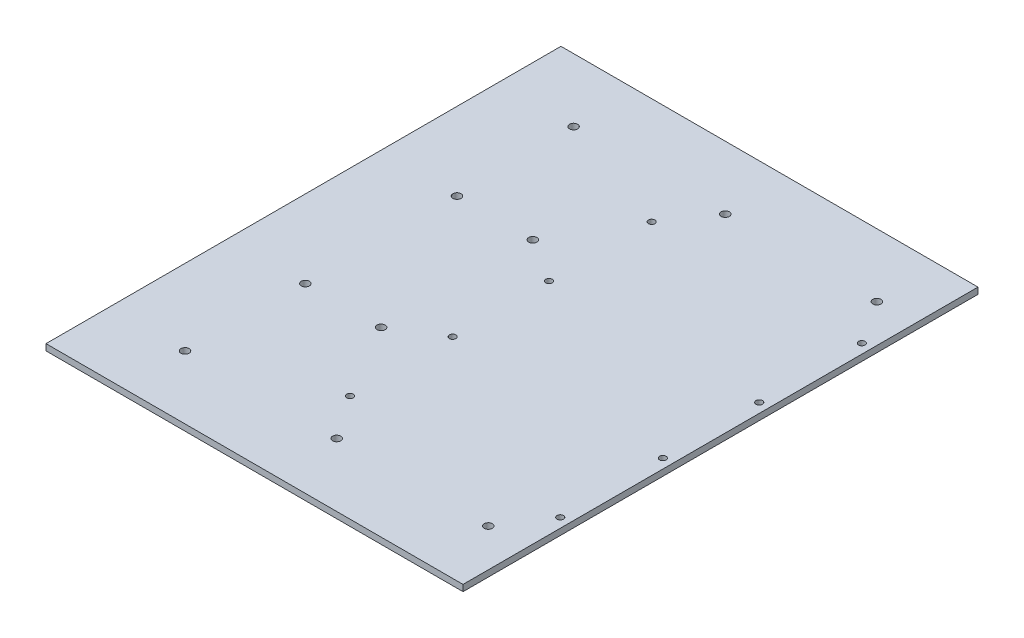
ISO-10303-21;
HEADER;
FILE_DESCRIPTION(('STEP AP214'),'2;1');
FILE_NAME('part.step','',(''),(''),'','','');
FILE_SCHEMA(('AUTOMOTIVE_DESIGN { 1 0 10303 214 1 1 1 1 }'));
ENDSEC;
DATA;
#1=APPLICATION_CONTEXT('core data for automotive mechanical design processes');
#2=APPLICATION_PROTOCOL_DEFINITION('international standard','automotive_design',2000,#1);
#3=PRODUCT_CONTEXT('',#1,'mechanical');
#4=PRODUCT('Part','Part','',(#3));
#5=PRODUCT_RELATED_PRODUCT_CATEGORY('part','',(#4));
#6=PRODUCT_DEFINITION_FORMATION('','',#4);
#7=PRODUCT_DEFINITION_CONTEXT('part definition',#1,'design');
#8=PRODUCT_DEFINITION('design','',#6,#7);
#9=PRODUCT_DEFINITION_SHAPE('','',#8);
#10=(LENGTH_UNIT() NAMED_UNIT(*) SI_UNIT(.MILLI.,.METRE.));
#11=(NAMED_UNIT(*) PLANE_ANGLE_UNIT() SI_UNIT($,.RADIAN.));
#12=(NAMED_UNIT(*) SI_UNIT($,.STERADIAN.) SOLID_ANGLE_UNIT());
#13=UNCERTAINTY_MEASURE_WITH_UNIT(LENGTH_MEASURE(1.E-05),#10,'distance_accuracy_value','');
#14=(GEOMETRIC_REPRESENTATION_CONTEXT(3) GLOBAL_UNCERTAINTY_ASSIGNED_CONTEXT((#13)) GLOBAL_UNIT_ASSIGNED_CONTEXT((#10,
#11,#12)) REPRESENTATION_CONTEXT('',''));
#15=CARTESIAN_POINT('',(0.,0.,0.));
#16=DIRECTION('',(0.,0.,1.));
#17=DIRECTION('',(1.,0.,0.));
#18=AXIS2_PLACEMENT_3D('',#15,#16,#17);
#19=CARTESIAN_POINT('',(0.,0.,0.));
#20=DIRECTION('',(0.,-1.,0.));
#21=DIRECTION('',(0.,0.,-1.));
#22=AXIS2_PLACEMENT_3D('',#19,#20,#21);
#23=PLANE('',#22);
#24=CARTESIAN_POINT('',(112.432352941177,0.,195.262500000001));
#25=DIRECTION('',(0.,1.,0.));
#26=DIRECTION('',(0.,0.,1.));
#27=AXIS2_PLACEMENT_3D('',#24,#25,#26);
#28=CIRCLE('',#27,4.10209999999999);
#29=CARTESIAN_POINT('',(112.432352941177,0.,199.364600000001));
#30=VERTEX_POINT('',#29);
#31=EDGE_CURVE('E206',#30,#30,#28,.T.);
#32=ORIENTED_EDGE('',*,*,#31,.F.);
#33=EDGE_LOOP('',(#32));
#34=FACE_BOUND('',#33,.T.);
#35=CARTESIAN_POINT('',(-39.9676470588235,0.,195.262500000002));
#36=DIRECTION('',(0.,1.,0.));
#37=DIRECTION('',(0.,0.,1.));
#38=AXIS2_PLACEMENT_3D('',#35,#36,#37);
#39=CIRCLE('',#38,4.10209999999999);
#40=CARTESIAN_POINT('',(-39.9676470588235,0.,199.364600000002));
#41=VERTEX_POINT('',#40);
#42=EDGE_CURVE('E212',#41,#41,#39,.T.);
#43=ORIENTED_EDGE('',*,*,#42,.F.);
#44=EDGE_LOOP('',(#43));
#45=FACE_BOUND('',#44,.T.);
#46=CARTESIAN_POINT('',(264.832352941177,0.,-195.2625));
#47=DIRECTION('',(0.,1.,0.));
#48=DIRECTION('',(0.,0.,1.));
#49=AXIS2_PLACEMENT_3D('',#46,#47,#48);
#50=CIRCLE('',#49,4.10209999999999);
#51=CARTESIAN_POINT('',(264.832352941177,0.,-191.1604));
#52=VERTEX_POINT('',#51);
#53=EDGE_CURVE('E228',#52,#52,#50,.T.);
#54=ORIENTED_EDGE('',*,*,#53,.F.);
#55=EDGE_LOOP('',(#54));
#56=FACE_BOUND('',#55,.T.);
#57=CARTESIAN_POINT('',(-39.9676470588235,0.,-195.262499999998));
#58=DIRECTION('',(0.,1.,0.));
#59=DIRECTION('',(0.,0.,1.));
#60=AXIS2_PLACEMENT_3D('',#57,#58,#59);
#61=CIRCLE('',#60,4.10209999999999);
#62=CARTESIAN_POINT('',(-39.9676470588235,0.,-191.160399999998));
#63=VERTEX_POINT('',#62);
#64=EDGE_CURVE('E221',#63,#63,#61,.T.);
#65=ORIENTED_EDGE('',*,*,#64,.F.);
#66=EDGE_LOOP('',(#65));
#67=FACE_BOUND('',#66,.T.);
#68=CARTESIAN_POINT('',(112.432352941177,0.,-195.262499999999));
#69=DIRECTION('',(0.,1.,0.));
#70=DIRECTION('',(0.,0.,1.));
#71=AXIS2_PLACEMENT_3D('',#68,#69,#70);
#72=CIRCLE('',#71,4.10209999999999);
#73=CARTESIAN_POINT('',(112.432352941177,0.,-191.160399999999));
#74=VERTEX_POINT('',#73);
#75=EDGE_CURVE('E220',#74,#74,#72,.T.);
#76=ORIENTED_EDGE('',*,*,#75,.F.);
#77=EDGE_LOOP('',(#76));
#78=FACE_BOUND('',#77,.T.);
#79=CARTESIAN_POINT('',(264.832352941177,0.,195.2625));
#80=DIRECTION('',(0.,1.,0.));
#81=DIRECTION('',(0.,0.,1.));
#82=AXIS2_PLACEMENT_3D('',#79,#80,#81);
#83=CIRCLE('',#82,4.10209999999999);
#84=CARTESIAN_POINT('',(264.832352941177,0.,199.3646));
#85=VERTEX_POINT('',#84);
#86=EDGE_CURVE('E210',#85,#85,#83,.T.);
#87=ORIENTED_EDGE('',*,*,#86,.F.);
#88=EDGE_LOOP('',(#87));
#89=FACE_BOUND('',#88,.T.);
#90=CARTESIAN_POINT('',(-38.1,0.,76.2));
#91=DIRECTION('',(0.,1.,0.));
#92=DIRECTION('',(0.,0.,1.));
#93=AXIS2_PLACEMENT_3D('',#90,#91,#92);
#94=CIRCLE('',#93,4.1021);
#95=CARTESIAN_POINT('',(-38.1,0.,80.3021));
#96=VERTEX_POINT('',#95);
#97=EDGE_CURVE('E239',#96,#96,#94,.T.);
#98=ORIENTED_EDGE('',*,*,#97,.F.);
#99=EDGE_LOOP('',(#98));
#100=FACE_BOUND('',#99,.T.);
#101=CARTESIAN_POINT('',(38.1,0.,76.2));
#102=DIRECTION('',(0.,1.,0.));
#103=DIRECTION('',(0.,0.,1.));
#104=AXIS2_PLACEMENT_3D('',#101,#102,#103);
#105=CIRCLE('',#104,4.1021);
#106=CARTESIAN_POINT('',(38.1,0.,80.3021));
#107=VERTEX_POINT('',#106);
#108=EDGE_CURVE('E246',#107,#107,#105,.T.);
#109=ORIENTED_EDGE('',*,*,#108,.F.);
#110=EDGE_LOOP('',(#109));
#111=FACE_BOUND('',#110,.T.);
#112=CARTESIAN_POINT('',(38.1,0.,-76.2));
#113=DIRECTION('',(0.,1.,0.));
#114=DIRECTION('',(0.,0.,1.));
#115=AXIS2_PLACEMENT_3D('',#112,#113,#114);
#116=CIRCLE('',#115,4.1021);
#117=CARTESIAN_POINT('',(38.1,0.,-72.0979));
#118=VERTEX_POINT('',#117);
#119=EDGE_CURVE('E252',#118,#118,#116,.T.);
#120=ORIENTED_EDGE('',*,*,#119,.F.);
#121=EDGE_LOOP('',(#120));
#122=FACE_BOUND('',#121,.T.);
#123=CARTESIAN_POINT('',(-38.1,0.,-76.2));
#124=DIRECTION('',(0.,1.,0.));
#125=DIRECTION('',(0.,0.,1.));
#126=AXIS2_PLACEMENT_3D('',#123,#124,#125);
#127=CIRCLE('',#126,4.1021);
#128=CARTESIAN_POINT('',(-38.1,0.,-72.0979));
#129=VERTEX_POINT('',#128);
#130=EDGE_CURVE('E258',#129,#129,#127,.T.);
#131=ORIENTED_EDGE('',*,*,#130,.F.);
#132=EDGE_LOOP('',(#131));
#133=FACE_BOUND('',#132,.T.);
#134=CARTESIAN_POINT('',(82.1428529411764,0.,48.4380000000001));
#135=DIRECTION('',(0.,1.,0.));
#136=DIRECTION('',(0.,0.,1.));
#137=AXIS2_PLACEMENT_3D('',#134,#135,#136);
#138=CIRCLE('',#137,3.26389999999999);
#139=CARTESIAN_POINT('',(82.1428529411764,0.,51.7019));
#140=VERTEX_POINT('',#139);
#141=EDGE_CURVE('E276',#140,#140,#138,.T.);
#142=ORIENTED_EDGE('',*,*,#141,.F.);
#143=EDGE_LOOP('',(#142));
#144=FACE_BOUND('',#143,.T.);
#145=CARTESIAN_POINT('',(293.407352941176,0.,48.438));
#146=DIRECTION('',(0.,1.,0.));
#147=DIRECTION('',(0.,0.,1.));
#148=AXIS2_PLACEMENT_3D('',#145,#146,#147);
#149=CIRCLE('',#148,3.26389999999999);
#150=CARTESIAN_POINT('',(293.407352941176,0.,51.7019));
#151=VERTEX_POINT('',#150);
#152=EDGE_CURVE('E282',#151,#151,#149,.T.);
#153=ORIENTED_EDGE('',*,*,#152,.F.);
#154=EDGE_LOOP('',(#153));
#155=FACE_BOUND('',#154,.T.);
#156=CARTESIAN_POINT('',(293.407352941176,0.,-48.438));
#157=DIRECTION('',(0.,1.,0.));
#158=DIRECTION('',(0.,0.,1.));
#159=AXIS2_PLACEMENT_3D('',#156,#157,#158);
#160=CIRCLE('',#159,3.26389999999999);
#161=CARTESIAN_POINT('',(293.407352941176,0.,-45.1741));
#162=VERTEX_POINT('',#161);
#163=EDGE_CURVE('E288',#162,#162,#160,.T.);
#164=ORIENTED_EDGE('',*,*,#163,.F.);
#165=EDGE_LOOP('',(#164));
#166=FACE_BOUND('',#165,.T.);
#167=CARTESIAN_POINT('',(82.1428529411764,0.,-48.4380000000001));
#168=DIRECTION('',(0.,1.,0.));
#169=DIRECTION('',(0.,0.,1.));
#170=AXIS2_PLACEMENT_3D('',#167,#168,#169);
#171=CIRCLE('',#170,3.26389999999999);
#172=CARTESIAN_POINT('',(82.1428529411764,0.,-45.1741000000001));
#173=VERTEX_POINT('',#172);
#174=EDGE_CURVE('E294',#173,#173,#171,.T.);
#175=ORIENTED_EDGE('',*,*,#174,.F.);
#176=EDGE_LOOP('',(#175));
#177=FACE_BOUND('',#176,.T.);
#178=CARTESIAN_POINT('',(82.1428529411764,0.,-151.562));
#179=DIRECTION('',(0.,1.,0.));
#180=DIRECTION('',(0.,0.,1.));
#181=AXIS2_PLACEMENT_3D('',#178,#179,#180);
#182=CIRCLE('',#181,3.26389999999999);
#183=CARTESIAN_POINT('',(82.1428529411764,0.,-148.2981));
#184=VERTEX_POINT('',#183);
#185=EDGE_CURVE('E300',#184,#184,#182,.T.);
#186=ORIENTED_EDGE('',*,*,#185,.F.);
#187=EDGE_LOOP('',(#186));
#188=FACE_BOUND('',#187,.T.);
#189=DIRECTION('',(0.,0.,-1.));
#190=VECTOR('',#189,1.);
#191=CARTESIAN_POINT('',(302.932352941177,0.,258.7625));
#192=LINE('',#191,#190);
#193=CARTESIAN_POINT('',(302.932352941177,0.,258.7625));
#194=VERTEX_POINT('',#193);
#195=CARTESIAN_POINT('',(302.932352941177,0.,-258.7625));
#196=VERTEX_POINT('',#195);
#197=EDGE_CURVE('E98',#194,#196,#192,.T.);
#198=ORIENTED_EDGE('',*,*,#197,.T.);
#199=DIRECTION('',(-1.,0.,0.));
#200=VECTOR('',#199,1.);
#201=CARTESIAN_POINT('',(-116.167647058823,0.,-258.7625));
#202=LINE('',#201,#200);
#203=CARTESIAN_POINT('',(-116.167647058823,0.,-258.7625));
#204=VERTEX_POINT('',#203);
#205=EDGE_CURVE('E101',#196,#204,#202,.T.);
#206=ORIENTED_EDGE('',*,*,#205,.T.);
#207=DIRECTION('',(0.,0.,1.));
#208=VECTOR('',#207,1.);
#209=CARTESIAN_POINT('',(-116.167647058823,0.,258.7625));
#210=LINE('',#209,#208);
#211=CARTESIAN_POINT('',(-116.167647058823,0.,258.7625));
#212=VERTEX_POINT('',#211);
#213=EDGE_CURVE('E83',#204,#212,#210,.T.);
#214=ORIENTED_EDGE('',*,*,#213,.T.);
#215=DIRECTION('',(1.,0.,0.));
#216=VECTOR('',#215,1.);
#217=CARTESIAN_POINT('',(-116.167647058823,0.,258.7625));
#218=LINE('',#217,#216);
#219=EDGE_CURVE('E93',#212,#194,#218,.T.);
#220=ORIENTED_EDGE('',*,*,#219,.T.);
#221=EDGE_LOOP('',(#198,#206,#214,#220));
#222=FACE_BOUND('',#221,.T.);
#223=CARTESIAN_POINT('',(293.407352941177,0.,-151.562));
#224=DIRECTION('',(0.,1.,0.));
#225=DIRECTION('',(0.,0.,1.));
#226=AXIS2_PLACEMENT_3D('',#223,#224,#225);
#227=CIRCLE('',#226,3.26389999999999);
#228=CARTESIAN_POINT('',(293.407352941177,0.,-148.2981));
#229=VERTEX_POINT('',#228);
#230=EDGE_CURVE('E306',#229,#229,#227,.T.);
#231=ORIENTED_EDGE('',*,*,#230,.F.);
#232=EDGE_LOOP('',(#231));
#233=FACE_BOUND('',#232,.T.);
#234=CARTESIAN_POINT('',(293.407352941177,0.,151.562));
#235=DIRECTION('',(0.,1.,0.));
#236=DIRECTION('',(0.,0.,1.));
#237=AXIS2_PLACEMENT_3D('',#234,#235,#236);
#238=CIRCLE('',#237,3.26389999999999);
#239=CARTESIAN_POINT('',(293.407352941177,0.,154.8259));
#240=VERTEX_POINT('',#239);
#241=EDGE_CURVE('E270',#240,#240,#238,.T.);
#242=ORIENTED_EDGE('',*,*,#241,.F.);
#243=EDGE_LOOP('',(#242));
#244=FACE_BOUND('',#243,.T.);
#245=CARTESIAN_POINT('',(82.1428529411764,0.,151.562));
#246=DIRECTION('',(0.,1.,0.));
#247=DIRECTION('',(0.,0.,1.));
#248=AXIS2_PLACEMENT_3D('',#245,#246,#247);
#249=CIRCLE('',#248,3.26389999999999);
#250=CARTESIAN_POINT('',(82.1428529411764,0.,154.8259));
#251=VERTEX_POINT('',#250);
#252=EDGE_CURVE('E264',#251,#251,#249,.T.);
#253=ORIENTED_EDGE('',*,*,#252,.F.);
#254=EDGE_LOOP('',(#253));
#255=FACE_BOUND('',#254,.T.);
#256=ADVANCED_FACE('F32',(#34,#45,#56,#67,#78,#89,#100,#111,#122,#133,#144,#155,#166,#177,#188,
#222,#233,#244,#255),#23,.F.);
#257=CARTESIAN_POINT('',(302.932352941177,-6.35,258.7625));
#258=DIRECTION('',(1.,0.,0.));
#259=DIRECTION('',(0.,0.,-1.));
#260=AXIS2_PLACEMENT_3D('',#257,#258,#259);
#261=PLANE('',#260);
#262=ORIENTED_EDGE('',*,*,#197,.F.);
#263=DIRECTION('',(0.,1.,0.));
#264=VECTOR('',#263,1.);
#265=CARTESIAN_POINT('',(302.932352941177,-6.35,258.7625));
#266=LINE('',#265,#264);
#267=CARTESIAN_POINT('',(302.932352941177,-6.35,258.7625));
#268=VERTEX_POINT('',#267);
#269=EDGE_CURVE('E11',#268,#194,#266,.T.);
#270=ORIENTED_EDGE('',*,*,#269,.F.);
#271=DIRECTION('',(0.,0.,-1.));
#272=VECTOR('',#271,1.);
#273=CARTESIAN_POINT('',(302.932352941177,-6.35,258.7625));
#274=LINE('',#273,#272);
#275=CARTESIAN_POINT('',(302.932352941177,-6.35,-258.7625));
#276=VERTEX_POINT('',#275);
#277=EDGE_CURVE('E91',#268,#276,#274,.T.);
#278=ORIENTED_EDGE('',*,*,#277,.T.);
#279=DIRECTION('',(0.,1.,0.));
#280=VECTOR('',#279,1.);
#281=CARTESIAN_POINT('',(302.932352941177,-6.35,-258.7625));
#282=LINE('',#281,#280);
#283=EDGE_CURVE('E36',#276,#196,#282,.T.);
#284=ORIENTED_EDGE('',*,*,#283,.T.);
#285=EDGE_LOOP('',(#262,#270,#278,#284));
#286=FACE_BOUND('',#285,.T.);
#287=ADVANCED_FACE('F34',(#286),#261,.T.);
#288=CARTESIAN_POINT('',(-116.167647058823,-6.35,258.7625));
#289=DIRECTION('',(0.,0.,1.));
#290=DIRECTION('',(1.,0.,0.));
#291=AXIS2_PLACEMENT_3D('',#288,#289,#290);
#292=PLANE('',#291);
#293=ORIENTED_EDGE('',*,*,#219,.F.);
#294=DIRECTION('',(0.,1.,0.));
#295=VECTOR('',#294,1.);
#296=CARTESIAN_POINT('',(-116.167647058823,-6.35,258.7625));
#297=LINE('',#296,#295);
#298=CARTESIAN_POINT('',(-116.167647058823,-6.35,258.7625));
#299=VERTEX_POINT('',#298);
#300=EDGE_CURVE('E42',#299,#212,#297,.T.);
#301=ORIENTED_EDGE('',*,*,#300,.F.);
#302=DIRECTION('',(1.,0.,0.));
#303=VECTOR('',#302,1.);
#304=CARTESIAN_POINT('',(-116.167647058823,-6.35,258.7625));
#305=LINE('',#304,#303);
#306=EDGE_CURVE('E88',#299,#268,#305,.T.);
#307=ORIENTED_EDGE('',*,*,#306,.T.);
#308=ORIENTED_EDGE('',*,*,#269,.T.);
#309=EDGE_LOOP('',(#293,#301,#307,#308));
#310=FACE_BOUND('',#309,.T.);
#311=ADVANCED_FACE('F109',(#310),#292,.T.);
#312=CARTESIAN_POINT('',(-116.167647058823,-6.35,258.7625));
#313=DIRECTION('',(-1.,0.,0.));
#314=DIRECTION('',(0.,0.,1.));
#315=AXIS2_PLACEMENT_3D('',#312,#313,#314);
#316=PLANE('',#315);
#317=ORIENTED_EDGE('',*,*,#213,.F.);
#318=DIRECTION('',(0.,1.,0.));
#319=VECTOR('',#318,1.);
#320=CARTESIAN_POINT('',(-116.167647058823,-6.35,-258.7625));
#321=LINE('',#320,#319);
#322=CARTESIAN_POINT('',(-116.167647058823,-6.35,-258.7625));
#323=VERTEX_POINT('',#322);
#324=EDGE_CURVE('E78',#323,#204,#321,.T.);
#325=ORIENTED_EDGE('',*,*,#324,.F.);
#326=DIRECTION('',(0.,0.,1.));
#327=VECTOR('',#326,1.);
#328=CARTESIAN_POINT('',(-116.167647058823,-6.35,258.7625));
#329=LINE('',#328,#327);
#330=EDGE_CURVE('E81',#323,#299,#329,.T.);
#331=ORIENTED_EDGE('',*,*,#330,.T.);
#332=ORIENTED_EDGE('',*,*,#300,.T.);
#333=EDGE_LOOP('',(#317,#325,#331,#332));
#334=FACE_BOUND('',#333,.T.);
#335=ADVANCED_FACE('F80',(#334),#316,.T.);
#336=CARTESIAN_POINT('',(-116.167647058823,-6.35,-258.7625));
#337=DIRECTION('',(0.,0.,-1.));
#338=DIRECTION('',(-1.,0.,0.));
#339=AXIS2_PLACEMENT_3D('',#336,#337,#338);
#340=PLANE('',#339);
#341=ORIENTED_EDGE('',*,*,#205,.F.);
#342=ORIENTED_EDGE('',*,*,#283,.F.);
#343=DIRECTION('',(-1.,0.,0.));
#344=VECTOR('',#343,1.);
#345=CARTESIAN_POINT('',(-116.167647058823,-6.35,-258.7625));
#346=LINE('',#345,#344);
#347=EDGE_CURVE('E87',#276,#323,#346,.T.);
#348=ORIENTED_EDGE('',*,*,#347,.T.);
#349=ORIENTED_EDGE('',*,*,#324,.T.);
#350=EDGE_LOOP('',(#341,#342,#348,#349));
#351=FACE_BOUND('',#350,.T.);
#352=ADVANCED_FACE('F90',(#351),#340,.T.);
#353=CARTESIAN_POINT('',(0.,-6.35,0.));
#354=DIRECTION('',(0.,-1.,0.));
#355=DIRECTION('',(0.,0.,-1.));
#356=AXIS2_PLACEMENT_3D('',#353,#354,#355);
#357=PLANE('',#356);
#358=CARTESIAN_POINT('',(112.432352941177,-6.35,195.262500000001));
#359=DIRECTION('',(0.,-1.,0.));
#360=DIRECTION('',(0.,0.,-1.));
#361=AXIS2_PLACEMENT_3D('',#358,#359,#360);
#362=CIRCLE('',#361,4.10209999999999);
#363=CARTESIAN_POINT('',(112.432352941177,-6.35,191.160400000001));
#364=VERTEX_POINT('',#363);
#365=EDGE_CURVE('E204',#364,#364,#362,.F.);
#366=ORIENTED_EDGE('',*,*,#365,.T.);
#367=EDGE_LOOP('',(#366));
#368=FACE_BOUND('',#367,.T.);
#369=CARTESIAN_POINT('',(-39.9676470588235,-6.35,195.262500000002));
#370=DIRECTION('',(0.,-1.,0.));
#371=DIRECTION('',(0.,0.,-1.));
#372=AXIS2_PLACEMENT_3D('',#369,#370,#371);
#373=CIRCLE('',#372,4.10209999999999);
#374=CARTESIAN_POINT('',(-39.9676470588235,-6.35,191.160400000002));
#375=VERTEX_POINT('',#374);
#376=EDGE_CURVE('E217',#375,#375,#373,.F.);
#377=ORIENTED_EDGE('',*,*,#376,.T.);
#378=EDGE_LOOP('',(#377));
#379=FACE_BOUND('',#378,.T.);
#380=CARTESIAN_POINT('',(264.832352941177,-6.35,-195.2625));
#381=DIRECTION('',(0.,-1.,0.));
#382=DIRECTION('',(0.,0.,-1.));
#383=AXIS2_PLACEMENT_3D('',#380,#381,#382);
#384=CIRCLE('',#383,4.10209999999999);
#385=CARTESIAN_POINT('',(264.832352941177,-6.35,-199.3646));
#386=VERTEX_POINT('',#385);
#387=EDGE_CURVE('E231',#386,#386,#384,.F.);
#388=ORIENTED_EDGE('',*,*,#387,.T.);
#389=EDGE_LOOP('',(#388));
#390=FACE_BOUND('',#389,.T.);
#391=CARTESIAN_POINT('',(-39.9676470588235,-6.35,-195.262499999998));
#392=DIRECTION('',(0.,-1.,0.));
#393=DIRECTION('',(0.,0.,-1.));
#394=AXIS2_PLACEMENT_3D('',#391,#392,#393);
#395=CIRCLE('',#394,4.10209999999999);
#396=CARTESIAN_POINT('',(-39.9676470588235,-6.35,-199.364599999998));
#397=VERTEX_POINT('',#396);
#398=EDGE_CURVE('E225',#397,#397,#395,.F.);
#399=ORIENTED_EDGE('',*,*,#398,.T.);
#400=EDGE_LOOP('',(#399));
#401=FACE_BOUND('',#400,.T.);
#402=CARTESIAN_POINT('',(112.432352941177,-6.35,-195.262499999999));
#403=DIRECTION('',(0.,-1.,0.));
#404=DIRECTION('',(0.,0.,-1.));
#405=AXIS2_PLACEMENT_3D('',#402,#403,#404);
#406=CIRCLE('',#405,4.10209999999999);
#407=CARTESIAN_POINT('',(112.432352941177,-6.35,-199.364599999999));
#408=VERTEX_POINT('',#407);
#409=EDGE_CURVE('E224',#408,#408,#406,.F.);
#410=ORIENTED_EDGE('',*,*,#409,.T.);
#411=EDGE_LOOP('',(#410));
#412=FACE_BOUND('',#411,.T.);
#413=CARTESIAN_POINT('',(264.832352941177,-6.35,195.2625));
#414=DIRECTION('',(0.,-1.,0.));
#415=DIRECTION('',(0.,0.,-1.));
#416=AXIS2_PLACEMENT_3D('',#413,#414,#415);
#417=CIRCLE('',#416,4.10209999999999);
#418=CARTESIAN_POINT('',(264.832352941177,-6.35,191.1604));
#419=VERTEX_POINT('',#418);
#420=EDGE_CURVE('E207',#419,#419,#417,.F.);
#421=ORIENTED_EDGE('',*,*,#420,.T.);
#422=EDGE_LOOP('',(#421));
#423=FACE_BOUND('',#422,.T.);
#424=CARTESIAN_POINT('',(-38.1,-6.35,76.2));
#425=DIRECTION('',(0.,1.,0.));
#426=DIRECTION('',(0.,0.,1.));
#427=AXIS2_PLACEMENT_3D('',#424,#425,#426);
#428=CIRCLE('',#427,4.1021);
#429=CARTESIAN_POINT('',(-38.1,-6.35,80.3021));
#430=VERTEX_POINT('',#429);
#431=EDGE_CURVE('E243',#430,#430,#428,.T.);
#432=ORIENTED_EDGE('',*,*,#431,.T.);
#433=EDGE_LOOP('',(#432));
#434=FACE_BOUND('',#433,.T.);
#435=CARTESIAN_POINT('',(38.1,-6.35,76.2));
#436=DIRECTION('',(0.,1.,0.));
#437=DIRECTION('',(0.,0.,1.));
#438=AXIS2_PLACEMENT_3D('',#435,#436,#437);
#439=CIRCLE('',#438,4.1021);
#440=CARTESIAN_POINT('',(38.1,-6.35,80.3021));
#441=VERTEX_POINT('',#440);
#442=EDGE_CURVE('E249',#441,#441,#439,.T.);
#443=ORIENTED_EDGE('',*,*,#442,.T.);
#444=EDGE_LOOP('',(#443));
#445=FACE_BOUND('',#444,.T.);
#446=CARTESIAN_POINT('',(38.1,-6.35,-76.2));
#447=DIRECTION('',(0.,1.,0.));
#448=DIRECTION('',(0.,0.,1.));
#449=AXIS2_PLACEMENT_3D('',#446,#447,#448);
#450=CIRCLE('',#449,4.1021);
#451=CARTESIAN_POINT('',(38.1,-6.35,-72.0979));
#452=VERTEX_POINT('',#451);
#453=EDGE_CURVE('E255',#452,#452,#450,.T.);
#454=ORIENTED_EDGE('',*,*,#453,.T.);
#455=EDGE_LOOP('',(#454));
#456=FACE_BOUND('',#455,.T.);
#457=CARTESIAN_POINT('',(-38.1,-6.35,-76.2));
#458=DIRECTION('',(0.,1.,0.));
#459=DIRECTION('',(0.,0.,1.));
#460=AXIS2_PLACEMENT_3D('',#457,#458,#459);
#461=CIRCLE('',#460,4.1021);
#462=CARTESIAN_POINT('',(-38.1,-6.35,-72.0979));
#463=VERTEX_POINT('',#462);
#464=EDGE_CURVE('E261',#463,#463,#461,.T.);
#465=ORIENTED_EDGE('',*,*,#464,.T.);
#466=EDGE_LOOP('',(#465));
#467=FACE_BOUND('',#466,.T.);
#468=CARTESIAN_POINT('',(82.1428529411764,-6.35,151.562));
#469=DIRECTION('',(0.,-1.,0.));
#470=DIRECTION('',(0.,0.,-1.));
#471=AXIS2_PLACEMENT_3D('',#468,#469,#470);
#472=CIRCLE('',#471,3.26389999999999);
#473=CARTESIAN_POINT('',(82.1428529411764,-6.35,148.2981));
#474=VERTEX_POINT('',#473);
#475=EDGE_CURVE('E267',#474,#474,#472,.T.);
#476=ORIENTED_EDGE('',*,*,#475,.F.);
#477=EDGE_LOOP('',(#476));
#478=FACE_BOUND('',#477,.T.);
#479=CARTESIAN_POINT('',(293.407352941177,-6.35,151.562));
#480=DIRECTION('',(0.,-1.,0.));
#481=DIRECTION('',(0.,0.,-1.));
#482=AXIS2_PLACEMENT_3D('',#479,#480,#481);
#483=CIRCLE('',#482,3.26389999999999);
#484=CARTESIAN_POINT('',(293.407352941177,-6.35,148.2981));
#485=VERTEX_POINT('',#484);
#486=EDGE_CURVE('E273',#485,#485,#483,.T.);
#487=ORIENTED_EDGE('',*,*,#486,.F.);
#488=EDGE_LOOP('',(#487));
#489=FACE_BOUND('',#488,.T.);
#490=CARTESIAN_POINT('',(82.1428529411764,-6.35,48.4380000000001));
#491=DIRECTION('',(0.,-1.,0.));
#492=DIRECTION('',(0.,0.,-1.));
#493=AXIS2_PLACEMENT_3D('',#490,#491,#492);
#494=CIRCLE('',#493,3.26389999999999);
#495=CARTESIAN_POINT('',(82.1428529411764,-6.35,45.1741000000001));
#496=VERTEX_POINT('',#495);
#497=EDGE_CURVE('E279',#496,#496,#494,.T.);
#498=ORIENTED_EDGE('',*,*,#497,.F.);
#499=EDGE_LOOP('',(#498));
#500=FACE_BOUND('',#499,.T.);
#501=CARTESIAN_POINT('',(293.407352941176,-6.35,48.438));
#502=DIRECTION('',(0.,-1.,0.));
#503=DIRECTION('',(0.,0.,-1.));
#504=AXIS2_PLACEMENT_3D('',#501,#502,#503);
#505=CIRCLE('',#504,3.26389999999999);
#506=CARTESIAN_POINT('',(293.407352941176,-6.35,45.1741));
#507=VERTEX_POINT('',#506);
#508=EDGE_CURVE('E285',#507,#507,#505,.T.);
#509=ORIENTED_EDGE('',*,*,#508,.F.);
#510=EDGE_LOOP('',(#509));
#511=FACE_BOUND('',#510,.T.);
#512=CARTESIAN_POINT('',(293.407352941176,-6.35,-48.438));
#513=DIRECTION('',(0.,-1.,0.));
#514=DIRECTION('',(0.,0.,-1.));
#515=AXIS2_PLACEMENT_3D('',#512,#513,#514);
#516=CIRCLE('',#515,3.26389999999999);
#517=CARTESIAN_POINT('',(293.407352941176,-6.35,-51.7019));
#518=VERTEX_POINT('',#517);
#519=EDGE_CURVE('E291',#518,#518,#516,.T.);
#520=ORIENTED_EDGE('',*,*,#519,.F.);
#521=EDGE_LOOP('',(#520));
#522=FACE_BOUND('',#521,.T.);
#523=CARTESIAN_POINT('',(82.1428529411764,-6.35,-48.4380000000001));
#524=DIRECTION('',(0.,-1.,0.));
#525=DIRECTION('',(0.,0.,-1.));
#526=AXIS2_PLACEMENT_3D('',#523,#524,#525);
#527=CIRCLE('',#526,3.26389999999999);
#528=CARTESIAN_POINT('',(82.1428529411764,-6.35,-51.7019));
#529=VERTEX_POINT('',#528);
#530=EDGE_CURVE('E297',#529,#529,#527,.T.);
#531=ORIENTED_EDGE('',*,*,#530,.F.);
#532=EDGE_LOOP('',(#531));
#533=FACE_BOUND('',#532,.T.);
#534=CARTESIAN_POINT('',(82.1428529411764,-6.35,-151.562));
#535=DIRECTION('',(0.,-1.,0.));
#536=DIRECTION('',(0.,0.,-1.));
#537=AXIS2_PLACEMENT_3D('',#534,#535,#536);
#538=CIRCLE('',#537,3.26389999999999);
#539=CARTESIAN_POINT('',(82.1428529411764,-6.35,-154.8259));
#540=VERTEX_POINT('',#539);
#541=EDGE_CURVE('E303',#540,#540,#538,.T.);
#542=ORIENTED_EDGE('',*,*,#541,.F.);
#543=EDGE_LOOP('',(#542));
#544=FACE_BOUND('',#543,.T.);
#545=CARTESIAN_POINT('',(293.407352941177,-6.35,-151.562));
#546=DIRECTION('',(0.,-1.,0.));
#547=DIRECTION('',(0.,0.,-1.));
#548=AXIS2_PLACEMENT_3D('',#545,#546,#547);
#549=CIRCLE('',#548,3.26389999999999);
#550=CARTESIAN_POINT('',(293.407352941177,-6.35,-154.8259));
#551=VERTEX_POINT('',#550);
#552=EDGE_CURVE('E102',#551,#551,#549,.T.);
#553=ORIENTED_EDGE('',*,*,#552,.F.);
#554=EDGE_LOOP('',(#553));
#555=FACE_BOUND('',#554,.T.);
#556=ORIENTED_EDGE('',*,*,#277,.F.);
#557=ORIENTED_EDGE('',*,*,#306,.F.);
#558=ORIENTED_EDGE('',*,*,#330,.F.);
#559=ORIENTED_EDGE('',*,*,#347,.F.);
#560=EDGE_LOOP('',(#556,#557,#558,#559));
#561=FACE_BOUND('',#560,.T.);
#562=ADVANCED_FACE('F86',(#368,#379,#390,#401,#412,#423,#434,#445,#456,#467,#478,#489,#500,#511,
#522,#533,#544,#555,#561),#357,.T.);
#563=CARTESIAN_POINT('',(293.407352941177,0.,-151.562));
#564=DIRECTION('',(0.,1.,0.));
#565=DIRECTION('',(0.,0.,1.));
#566=AXIS2_PLACEMENT_3D('',#563,#564,#565);
#567=CYLINDRICAL_SURFACE('',#566,3.26389999999999);
#568=ORIENTED_EDGE('',*,*,#230,.T.);
#569=EDGE_LOOP('',(#568));
#570=FACE_BOUND('',#569,.T.);
#571=ORIENTED_EDGE('',*,*,#552,.T.);
#572=EDGE_LOOP('',(#571));
#573=FACE_BOUND('',#572,.T.);
#574=ADVANCED_FACE('F127',(#570,#573),#567,.F.);
#575=CARTESIAN_POINT('',(82.1428529411764,0.,-151.562));
#576=DIRECTION('',(0.,1.,0.));
#577=DIRECTION('',(0.,0.,1.));
#578=AXIS2_PLACEMENT_3D('',#575,#576,#577);
#579=CYLINDRICAL_SURFACE('',#578,3.26389999999999);
#580=ORIENTED_EDGE('',*,*,#185,.T.);
#581=EDGE_LOOP('',(#580));
#582=FACE_BOUND('',#581,.T.);
#583=ORIENTED_EDGE('',*,*,#541,.T.);
#584=EDGE_LOOP('',(#583));
#585=FACE_BOUND('',#584,.T.);
#586=ADVANCED_FACE('F131',(#582,#585),#579,.F.);
#587=CARTESIAN_POINT('',(82.1428529411764,0.,-48.4380000000001));
#588=DIRECTION('',(0.,1.,0.));
#589=DIRECTION('',(0.,0.,1.));
#590=AXIS2_PLACEMENT_3D('',#587,#588,#589);
#591=CYLINDRICAL_SURFACE('',#590,3.26389999999999);
#592=ORIENTED_EDGE('',*,*,#174,.T.);
#593=EDGE_LOOP('',(#592));
#594=FACE_BOUND('',#593,.T.);
#595=ORIENTED_EDGE('',*,*,#530,.T.);
#596=EDGE_LOOP('',(#595));
#597=FACE_BOUND('',#596,.T.);
#598=ADVANCED_FACE('F135',(#594,#597),#591,.F.);
#599=CARTESIAN_POINT('',(293.407352941176,0.,-48.438));
#600=DIRECTION('',(0.,1.,0.));
#601=DIRECTION('',(0.,0.,1.));
#602=AXIS2_PLACEMENT_3D('',#599,#600,#601);
#603=CYLINDRICAL_SURFACE('',#602,3.26389999999999);
#604=ORIENTED_EDGE('',*,*,#163,.T.);
#605=EDGE_LOOP('',(#604));
#606=FACE_BOUND('',#605,.T.);
#607=ORIENTED_EDGE('',*,*,#519,.T.);
#608=EDGE_LOOP('',(#607));
#609=FACE_BOUND('',#608,.T.);
#610=ADVANCED_FACE('F139',(#606,#609),#603,.F.);
#611=CARTESIAN_POINT('',(293.407352941176,0.,48.438));
#612=DIRECTION('',(0.,1.,0.));
#613=DIRECTION('',(0.,0.,1.));
#614=AXIS2_PLACEMENT_3D('',#611,#612,#613);
#615=CYLINDRICAL_SURFACE('',#614,3.26389999999999);
#616=ORIENTED_EDGE('',*,*,#152,.T.);
#617=EDGE_LOOP('',(#616));
#618=FACE_BOUND('',#617,.T.);
#619=ORIENTED_EDGE('',*,*,#508,.T.);
#620=EDGE_LOOP('',(#619));
#621=FACE_BOUND('',#620,.T.);
#622=ADVANCED_FACE('F143',(#618,#621),#615,.F.);
#623=CARTESIAN_POINT('',(82.1428529411764,0.,48.4380000000001));
#624=DIRECTION('',(0.,1.,0.));
#625=DIRECTION('',(0.,0.,1.));
#626=AXIS2_PLACEMENT_3D('',#623,#624,#625);
#627=CYLINDRICAL_SURFACE('',#626,3.26389999999999);
#628=ORIENTED_EDGE('',*,*,#141,.T.);
#629=EDGE_LOOP('',(#628));
#630=FACE_BOUND('',#629,.T.);
#631=ORIENTED_EDGE('',*,*,#497,.T.);
#632=EDGE_LOOP('',(#631));
#633=FACE_BOUND('',#632,.T.);
#634=ADVANCED_FACE('F147',(#630,#633),#627,.F.);
#635=CARTESIAN_POINT('',(293.407352941177,0.,151.562));
#636=DIRECTION('',(0.,1.,0.));
#637=DIRECTION('',(0.,0.,1.));
#638=AXIS2_PLACEMENT_3D('',#635,#636,#637);
#639=CYLINDRICAL_SURFACE('',#638,3.26389999999999);
#640=ORIENTED_EDGE('',*,*,#241,.T.);
#641=EDGE_LOOP('',(#640));
#642=FACE_BOUND('',#641,.T.);
#643=ORIENTED_EDGE('',*,*,#486,.T.);
#644=EDGE_LOOP('',(#643));
#645=FACE_BOUND('',#644,.T.);
#646=ADVANCED_FACE('F151',(#642,#645),#639,.F.);
#647=CARTESIAN_POINT('',(82.1428529411764,0.,151.562));
#648=DIRECTION('',(0.,1.,0.));
#649=DIRECTION('',(0.,0.,1.));
#650=AXIS2_PLACEMENT_3D('',#647,#648,#649);
#651=CYLINDRICAL_SURFACE('',#650,3.26389999999999);
#652=ORIENTED_EDGE('',*,*,#252,.T.);
#653=EDGE_LOOP('',(#652));
#654=FACE_BOUND('',#653,.T.);
#655=ORIENTED_EDGE('',*,*,#475,.T.);
#656=EDGE_LOOP('',(#655));
#657=FACE_BOUND('',#656,.T.);
#658=ADVANCED_FACE('F155',(#654,#657),#651,.F.);
#659=CARTESIAN_POINT('',(-38.1,0.,-76.2));
#660=DIRECTION('',(0.,1.,0.));
#661=DIRECTION('',(0.,0.,1.));
#662=AXIS2_PLACEMENT_3D('',#659,#660,#661);
#663=CYLINDRICAL_SURFACE('',#662,4.1021);
#664=ORIENTED_EDGE('',*,*,#464,.F.);
#665=EDGE_LOOP('',(#664));
#666=FACE_BOUND('',#665,.T.);
#667=ORIENTED_EDGE('',*,*,#130,.T.);
#668=EDGE_LOOP('',(#667));
#669=FACE_BOUND('',#668,.T.);
#670=ADVANCED_FACE('F159',(#666,#669),#663,.F.);
#671=CARTESIAN_POINT('',(38.1,0.,-76.2));
#672=DIRECTION('',(0.,1.,0.));
#673=DIRECTION('',(0.,0.,1.));
#674=AXIS2_PLACEMENT_3D('',#671,#672,#673);
#675=CYLINDRICAL_SURFACE('',#674,4.1021);
#676=ORIENTED_EDGE('',*,*,#453,.F.);
#677=EDGE_LOOP('',(#676));
#678=FACE_BOUND('',#677,.T.);
#679=ORIENTED_EDGE('',*,*,#119,.T.);
#680=EDGE_LOOP('',(#679));
#681=FACE_BOUND('',#680,.T.);
#682=ADVANCED_FACE('F163',(#678,#681),#675,.F.);
#683=CARTESIAN_POINT('',(38.1,0.,76.2));
#684=DIRECTION('',(0.,1.,0.));
#685=DIRECTION('',(0.,0.,1.));
#686=AXIS2_PLACEMENT_3D('',#683,#684,#685);
#687=CYLINDRICAL_SURFACE('',#686,4.1021);
#688=ORIENTED_EDGE('',*,*,#442,.F.);
#689=EDGE_LOOP('',(#688));
#690=FACE_BOUND('',#689,.T.);
#691=ORIENTED_EDGE('',*,*,#108,.T.);
#692=EDGE_LOOP('',(#691));
#693=FACE_BOUND('',#692,.T.);
#694=ADVANCED_FACE('F167',(#690,#693),#687,.F.);
#695=CARTESIAN_POINT('',(-38.1,0.,76.2));
#696=DIRECTION('',(0.,1.,0.));
#697=DIRECTION('',(0.,0.,1.));
#698=AXIS2_PLACEMENT_3D('',#695,#696,#697);
#699=CYLINDRICAL_SURFACE('',#698,4.1021);
#700=ORIENTED_EDGE('',*,*,#431,.F.);
#701=EDGE_LOOP('',(#700));
#702=FACE_BOUND('',#701,.T.);
#703=ORIENTED_EDGE('',*,*,#97,.T.);
#704=EDGE_LOOP('',(#703));
#705=FACE_BOUND('',#704,.T.);
#706=ADVANCED_FACE('F171',(#702,#705),#699,.F.);
#707=CARTESIAN_POINT('',(264.832352941177,-6.351,195.2625));
#708=DIRECTION('',(0.,1.,0.));
#709=DIRECTION('',(0.,0.,1.));
#710=AXIS2_PLACEMENT_3D('',#707,#708,#709);
#711=CYLINDRICAL_SURFACE('',#710,4.10209999999999);
#712=ORIENTED_EDGE('',*,*,#420,.F.);
#713=EDGE_LOOP('',(#712));
#714=FACE_BOUND('',#713,.T.);
#715=ORIENTED_EDGE('',*,*,#86,.T.);
#716=EDGE_LOOP('',(#715));
#717=FACE_BOUND('',#716,.T.);
#718=ADVANCED_FACE('F175',(#714,#717),#711,.F.);
#719=CARTESIAN_POINT('',(112.432352941177,-6.351,-195.262499999999));
#720=DIRECTION('',(0.,1.,0.));
#721=DIRECTION('',(0.,0.,1.));
#722=AXIS2_PLACEMENT_3D('',#719,#720,#721);
#723=CYLINDRICAL_SURFACE('',#722,4.10209999999999);
#724=ORIENTED_EDGE('',*,*,#409,.F.);
#725=EDGE_LOOP('',(#724));
#726=FACE_BOUND('',#725,.T.);
#727=ORIENTED_EDGE('',*,*,#75,.T.);
#728=EDGE_LOOP('',(#727));
#729=FACE_BOUND('',#728,.T.);
#730=ADVANCED_FACE('F179',(#726,#729),#723,.F.);
#731=CARTESIAN_POINT('',(-39.9676470588235,-6.351,-195.262499999998));
#732=DIRECTION('',(0.,1.,0.));
#733=DIRECTION('',(0.,0.,1.));
#734=AXIS2_PLACEMENT_3D('',#731,#732,#733);
#735=CYLINDRICAL_SURFACE('',#734,4.10209999999999);
#736=ORIENTED_EDGE('',*,*,#398,.F.);
#737=EDGE_LOOP('',(#736));
#738=FACE_BOUND('',#737,.T.);
#739=ORIENTED_EDGE('',*,*,#64,.T.);
#740=EDGE_LOOP('',(#739));
#741=FACE_BOUND('',#740,.T.);
#742=ADVANCED_FACE('F183',(#738,#741),#735,.F.);
#743=CARTESIAN_POINT('',(264.832352941177,-6.351,-195.2625));
#744=DIRECTION('',(0.,1.,0.));
#745=DIRECTION('',(0.,0.,1.));
#746=AXIS2_PLACEMENT_3D('',#743,#744,#745);
#747=CYLINDRICAL_SURFACE('',#746,4.10209999999999);
#748=ORIENTED_EDGE('',*,*,#387,.F.);
#749=EDGE_LOOP('',(#748));
#750=FACE_BOUND('',#749,.T.);
#751=ORIENTED_EDGE('',*,*,#53,.T.);
#752=EDGE_LOOP('',(#751));
#753=FACE_BOUND('',#752,.T.);
#754=ADVANCED_FACE('F185',(#750,#753),#747,.F.);
#755=CARTESIAN_POINT('',(-39.9676470588235,-6.351,195.262500000002));
#756=DIRECTION('',(0.,1.,0.));
#757=DIRECTION('',(0.,0.,1.));
#758=AXIS2_PLACEMENT_3D('',#755,#756,#757);
#759=CYLINDRICAL_SURFACE('',#758,4.10209999999999);
#760=ORIENTED_EDGE('',*,*,#376,.F.);
#761=EDGE_LOOP('',(#760));
#762=FACE_BOUND('',#761,.T.);
#763=ORIENTED_EDGE('',*,*,#42,.T.);
#764=EDGE_LOOP('',(#763));
#765=FACE_BOUND('',#764,.T.);
#766=ADVANCED_FACE('F188',(#762,#765),#759,.F.);
#767=CARTESIAN_POINT('',(112.432352941177,-6.351,195.262500000001));
#768=DIRECTION('',(0.,1.,0.));
#769=DIRECTION('',(0.,0.,1.));
#770=AXIS2_PLACEMENT_3D('',#767,#768,#769);
#771=CYLINDRICAL_SURFACE('',#770,4.10209999999999);
#772=ORIENTED_EDGE('',*,*,#365,.F.);
#773=EDGE_LOOP('',(#772));
#774=FACE_BOUND('',#773,.T.);
#775=ORIENTED_EDGE('',*,*,#31,.T.);
#776=EDGE_LOOP('',(#775));
#777=FACE_BOUND('',#776,.T.);
#778=ADVANCED_FACE('F195',(#774,#777),#771,.F.);
#779=CLOSED_SHELL('',(#256,#287,#311,#335,#352,#562,#574,#586,#598,#610,#622,#634,#646,#658,
#670,#682,#694,#706,#718,#730,#742,#754,#766,#778));
#780=MANIFOLD_SOLID_BREP('B2',#779);
#781=ADVANCED_BREP_SHAPE_REPRESENTATION('',(#18,#780),#14);
#782=SHAPE_DEFINITION_REPRESENTATION(#9,#781);
ENDSEC;
END-ISO-10303-21;
